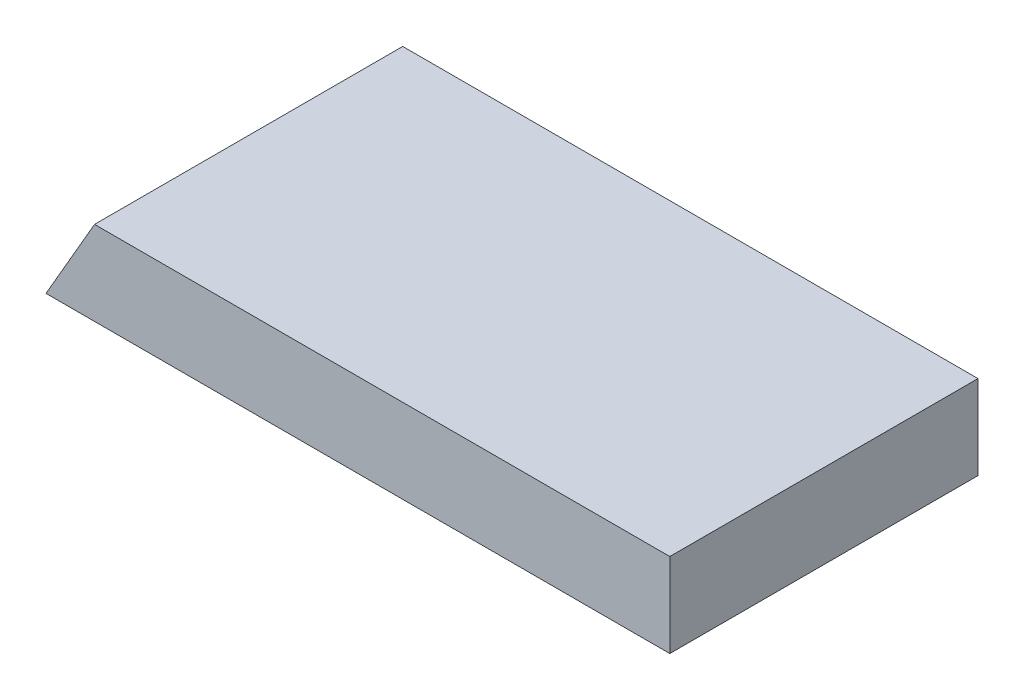
ISO-10303-21;
HEADER;
FILE_DESCRIPTION(('STEP AP214'),'2;1');
FILE_NAME('part.step','',(''),(''),'','','');
FILE_SCHEMA(('AUTOMOTIVE_DESIGN { 1 0 10303 214 1 1 1 1 }'));
ENDSEC;
DATA;
#1=APPLICATION_CONTEXT('core data for automotive mechanical design processes');
#2=APPLICATION_PROTOCOL_DEFINITION('international standard','automotive_design',2000,#1);
#3=PRODUCT_CONTEXT('',#1,'mechanical');
#4=PRODUCT('Part','Part','',(#3));
#5=PRODUCT_RELATED_PRODUCT_CATEGORY('part','',(#4));
#6=PRODUCT_DEFINITION_FORMATION('','',#4);
#7=PRODUCT_DEFINITION_CONTEXT('part definition',#1,'design');
#8=PRODUCT_DEFINITION('design','',#6,#7);
#9=PRODUCT_DEFINITION_SHAPE('','',#8);
#10=(LENGTH_UNIT() NAMED_UNIT(*) SI_UNIT(.MILLI.,.METRE.));
#11=(NAMED_UNIT(*) PLANE_ANGLE_UNIT() SI_UNIT($,.RADIAN.));
#12=(NAMED_UNIT(*) SI_UNIT($,.STERADIAN.) SOLID_ANGLE_UNIT());
#13=UNCERTAINTY_MEASURE_WITH_UNIT(LENGTH_MEASURE(1.E-05),#10,'distance_accuracy_value','');
#14=(GEOMETRIC_REPRESENTATION_CONTEXT(3) GLOBAL_UNCERTAINTY_ASSIGNED_CONTEXT((#13)) GLOBAL_UNIT_ASSIGNED_CONTEXT((#10,
#11,#12)) REPRESENTATION_CONTEXT('',''));
#15=CARTESIAN_POINT('',(0.,0.,0.));
#16=DIRECTION('',(0.,0.,1.));
#17=DIRECTION('',(1.,0.,0.));
#18=AXIS2_PLACEMENT_3D('',#15,#16,#17);
#19=CARTESIAN_POINT('',(0.,38.1,0.));
#20=DIRECTION('',(0.,0.,-1.));
#21=DIRECTION('',(-1.,0.,0.));
#22=AXIS2_PLACEMENT_3D('',#19,#20,#21);
#23=PLANE('',#22);
#24=DIRECTION('',(1.,0.,0.));
#25=VECTOR('',#24,1.);
#26=CARTESIAN_POINT('',(0.,38.1,0.));
#27=LINE('',#26,#25);
#28=CARTESIAN_POINT('',(120.25322989336,38.1,0.));
#29=VERTEX_POINT('',#28);
#30=CARTESIAN_POINT('',(381.,38.1,0.));
#31=VERTEX_POINT('',#30);
#32=EDGE_CURVE('E83',#29,#31,#27,.T.);
#33=ORIENTED_EDGE('',*,*,#32,.F.);
#34=DIRECTION('',(0.499999999999995,0.866025403784442,0.));
#35=VECTOR('',#34,1.);
#36=CARTESIAN_POINT('',(98.2561846372352,0.,0.));
#37=LINE('',#36,#35);
#38=CARTESIAN_POINT('',(98.2561846372352,0.,0.));
#39=VERTEX_POINT('',#38);
#40=EDGE_CURVE('E94',#39,#29,#37,.T.);
#41=ORIENTED_EDGE('',*,*,#40,.F.);
#42=DIRECTION('',(1.,0.,0.));
#43=VECTOR('',#42,1.);
#44=CARTESIAN_POINT('',(0.,0.,0.));
#45=LINE('',#44,#43);
#46=CARTESIAN_POINT('',(381.,0.,0.));
#47=VERTEX_POINT('',#46);
#48=EDGE_CURVE('E75',#39,#47,#45,.T.);
#49=ORIENTED_EDGE('',*,*,#48,.T.);
#50=DIRECTION('',(0.,-1.,0.));
#51=VECTOR('',#50,1.);
#52=CARTESIAN_POINT('',(381.,38.1,0.));
#53=LINE('',#52,#51);
#54=EDGE_CURVE('E11',#31,#47,#53,.T.);
#55=ORIENTED_EDGE('',*,*,#54,.F.);
#56=EDGE_LOOP('',(#33,#41,#49,#55));
#57=FACE_BOUND('',#56,.T.);
#58=ADVANCED_FACE('F31',(#57),#23,.F.);
#59=CARTESIAN_POINT('',(381.,38.1,0.));
#60=DIRECTION('',(-1.,0.,0.));
#61=DIRECTION('',(0.,0.,1.));
#62=AXIS2_PLACEMENT_3D('',#59,#60,#61);
#63=PLANE('',#62);
#64=DIRECTION('',(0.,0.,-1.));
#65=VECTOR('',#64,1.);
#66=CARTESIAN_POINT('',(381.,0.,0.));
#67=LINE('',#66,#65);
#68=CARTESIAN_POINT('',(381.,0.,-139.7));
#69=VERTEX_POINT('',#68);
#70=EDGE_CURVE('E66',#47,#69,#67,.T.);
#71=ORIENTED_EDGE('',*,*,#70,.T.);
#72=DIRECTION('',(0.,-1.,0.));
#73=VECTOR('',#72,1.);
#74=CARTESIAN_POINT('',(381.,38.1,-139.7));
#75=LINE('',#74,#73);
#76=CARTESIAN_POINT('',(381.,38.1,-139.7));
#77=VERTEX_POINT('',#76);
#78=EDGE_CURVE('E38',#77,#69,#75,.T.);
#79=ORIENTED_EDGE('',*,*,#78,.F.);
#80=DIRECTION('',(0.,0.,-1.));
#81=VECTOR('',#80,1.);
#82=CARTESIAN_POINT('',(381.,38.1,0.));
#83=LINE('',#82,#81);
#84=EDGE_CURVE('E54',#31,#77,#83,.T.);
#85=ORIENTED_EDGE('',*,*,#84,.F.);
#86=ORIENTED_EDGE('',*,*,#54,.T.);
#87=EDGE_LOOP('',(#71,#79,#85,#86));
#88=FACE_BOUND('',#87,.T.);
#89=ADVANCED_FACE('F68',(#88),#63,.F.);
#90=CARTESIAN_POINT('',(0.,38.1,-139.7));
#91=DIRECTION('',(0.,0.,1.));
#92=DIRECTION('',(1.,0.,0.));
#93=AXIS2_PLACEMENT_3D('',#90,#91,#92);
#94=PLANE('',#93);
#95=DIRECTION('',(-1.,0.,0.));
#96=VECTOR('',#95,1.);
#97=CARTESIAN_POINT('',(0.,0.,-139.7));
#98=LINE('',#97,#96);
#99=CARTESIAN_POINT('',(98.2561846372352,0.,-139.7));
#100=VERTEX_POINT('',#99);
#101=EDGE_CURVE('E74',#69,#100,#98,.T.);
#102=ORIENTED_EDGE('',*,*,#101,.T.);
#103=DIRECTION('',(0.499999999999995,0.866025403784442,0.));
#104=VECTOR('',#103,1.);
#105=CARTESIAN_POINT('',(98.2561846372352,0.,-139.7));
#106=LINE('',#105,#104);
#107=CARTESIAN_POINT('',(120.25322989336,38.1,-139.7));
#108=VERTEX_POINT('',#107);
#109=EDGE_CURVE('E45',#100,#108,#106,.T.);
#110=ORIENTED_EDGE('',*,*,#109,.T.);
#111=DIRECTION('',(-1.,0.,0.));
#112=VECTOR('',#111,1.);
#113=CARTESIAN_POINT('',(0.,38.1,-139.7));
#114=LINE('',#113,#112);
#115=EDGE_CURVE('E80',#77,#108,#114,.T.);
#116=ORIENTED_EDGE('',*,*,#115,.F.);
#117=ORIENTED_EDGE('',*,*,#78,.T.);
#118=EDGE_LOOP('',(#102,#110,#116,#117));
#119=FACE_BOUND('',#118,.T.);
#120=ADVANCED_FACE('F79',(#119),#94,.F.);
#121=CARTESIAN_POINT('',(0.,38.1,-139.7));
#122=DIRECTION('',(0.,-1.,0.));
#123=DIRECTION('',(0.,0.,-1.));
#124=AXIS2_PLACEMENT_3D('',#121,#122,#123);
#125=PLANE('',#124);
#126=ORIENTED_EDGE('',*,*,#115,.T.);
#127=DIRECTION('',(0.,0.,1.));
#128=VECTOR('',#127,1.);
#129=CARTESIAN_POINT('',(120.25322989336,38.1,-139.7));
#130=LINE('',#129,#128);
#131=EDGE_CURVE('E88',#108,#29,#130,.T.);
#132=ORIENTED_EDGE('',*,*,#131,.T.);
#133=ORIENTED_EDGE('',*,*,#32,.T.);
#134=ORIENTED_EDGE('',*,*,#84,.T.);
#135=EDGE_LOOP('',(#126,#132,#133,#134));
#136=FACE_BOUND('',#135,.T.);
#137=ADVANCED_FACE('F99',(#136),#125,.F.);
#138=CARTESIAN_POINT('',(0.,0.,-139.7));
#139=DIRECTION('',(0.,-1.,0.));
#140=DIRECTION('',(0.,0.,-1.));
#141=AXIS2_PLACEMENT_3D('',#138,#139,#140);
#142=PLANE('',#141);
#143=DIRECTION('',(0.,0.,1.));
#144=VECTOR('',#143,1.);
#145=CARTESIAN_POINT('',(98.2561846372352,0.,-139.7));
#146=LINE('',#145,#144);
#147=EDGE_CURVE('E82',#100,#39,#146,.T.);
#148=ORIENTED_EDGE('',*,*,#147,.F.);
#149=ORIENTED_EDGE('',*,*,#101,.F.);
#150=ORIENTED_EDGE('',*,*,#70,.F.);
#151=ORIENTED_EDGE('',*,*,#48,.F.);
#152=EDGE_LOOP('',(#148,#149,#150,#151));
#153=FACE_BOUND('',#152,.T.);
#154=ADVANCED_FACE('F81',(#153),#142,.T.);
#155=CARTESIAN_POINT('',(98.2561846372352,0.,-139.7));
#156=DIRECTION('',(0.866025403784442,-0.499999999999995,0.));
#157=DIRECTION('',(0.499999999999995,0.866025403784442,0.));
#158=AXIS2_PLACEMENT_3D('',#155,#156,#157);
#159=PLANE('',#158);
#160=ORIENTED_EDGE('',*,*,#40,.T.);
#161=ORIENTED_EDGE('',*,*,#131,.F.);
#162=ORIENTED_EDGE('',*,*,#109,.F.);
#163=ORIENTED_EDGE('',*,*,#147,.T.);
#164=EDGE_LOOP('',(#160,#161,#162,#163));
#165=FACE_BOUND('',#164,.T.);
#166=ADVANCED_FACE('F105',(#165),#159,.F.);
#167=CLOSED_SHELL('',(#58,#89,#120,#137,#154,#166));
#168=MANIFOLD_SOLID_BREP('B2',#167);
#169=ADVANCED_BREP_SHAPE_REPRESENTATION('',(#18,#168),#14);
#170=SHAPE_DEFINITION_REPRESENTATION(#9,#169);
ENDSEC;
END-ISO-10303-21;
